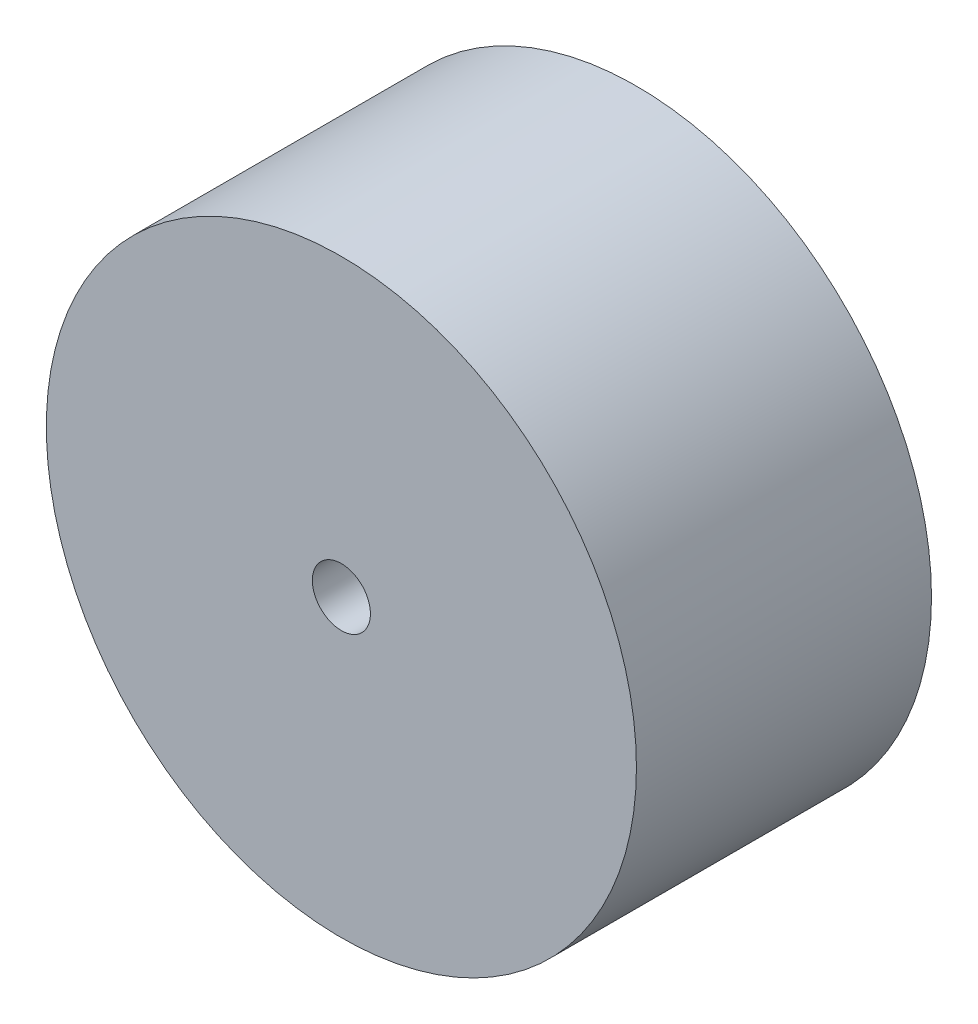
ISO-10303-21;
HEADER;
FILE_DESCRIPTION(('STEP AP214'),'2;1');
FILE_NAME('part.step','',(''),(''),'','','');
FILE_SCHEMA(('AUTOMOTIVE_DESIGN { 1 0 10303 214 1 1 1 1 }'));
ENDSEC;
DATA;
#1=APPLICATION_CONTEXT('core data for automotive mechanical design processes');
#2=APPLICATION_PROTOCOL_DEFINITION('international standard','automotive_design',2000,#1);
#3=PRODUCT_CONTEXT('',#1,'mechanical');
#4=PRODUCT('Part','Part','',(#3));
#5=PRODUCT_RELATED_PRODUCT_CATEGORY('part','',(#4));
#6=PRODUCT_DEFINITION_FORMATION('','',#4);
#7=PRODUCT_DEFINITION_CONTEXT('part definition',#1,'design');
#8=PRODUCT_DEFINITION('design','',#6,#7);
#9=PRODUCT_DEFINITION_SHAPE('','',#8);
#10=(LENGTH_UNIT() NAMED_UNIT(*) SI_UNIT(.MILLI.,.METRE.));
#11=(NAMED_UNIT(*) PLANE_ANGLE_UNIT() SI_UNIT($,.RADIAN.));
#12=(NAMED_UNIT(*) SI_UNIT($,.STERADIAN.) SOLID_ANGLE_UNIT());
#13=UNCERTAINTY_MEASURE_WITH_UNIT(LENGTH_MEASURE(1.E-05),#10,'distance_accuracy_value','');
#14=(GEOMETRIC_REPRESENTATION_CONTEXT(3) GLOBAL_UNCERTAINTY_ASSIGNED_CONTEXT((#13)) GLOBAL_UNIT_ASSIGNED_CONTEXT((#10,
#11,#12)) REPRESENTATION_CONTEXT('',''));
#15=CARTESIAN_POINT('',(0.,0.,0.));
#16=DIRECTION('',(0.,0.,1.));
#17=DIRECTION('',(1.,0.,0.));
#18=AXIS2_PLACEMENT_3D('',#15,#16,#17);
#19=CARTESIAN_POINT('',(0.,0.,25.4));
#20=DIRECTION('',(0.,0.,1.));
#21=DIRECTION('',(1.,0.,0.));
#22=AXIS2_PLACEMENT_3D('',#19,#20,#21);
#23=PLANE('',#22);
#24=CARTESIAN_POINT('',(0.,0.,25.4));
#25=DIRECTION('',(0.,0.,1.));
#26=DIRECTION('',(1.,0.,0.));
#27=AXIS2_PLACEMENT_3D('',#24,#25,#26);
#28=CIRCLE('',#27,25.4);
#29=CARTESIAN_POINT('',(25.4,0.,25.4));
#30=VERTEX_POINT('',#29);
#31=EDGE_CURVE('E10',#30,#30,#28,.T.);
#32=ORIENTED_EDGE('',*,*,#31,.T.);
#33=EDGE_LOOP('',(#32));
#34=FACE_BOUND('',#33,.T.);
#35=CARTESIAN_POINT('',(0.,0.,25.4));
#36=DIRECTION('',(0.,0.,1.));
#37=DIRECTION('',(1.,0.,0.));
#38=AXIS2_PLACEMENT_3D('',#35,#36,#37);
#39=CIRCLE('',#38,2.5);
#40=CARTESIAN_POINT('',(2.5,0.,25.4));
#41=VERTEX_POINT('',#40);
#42=EDGE_CURVE('E42',#41,#41,#39,.T.);
#43=ORIENTED_EDGE('',*,*,#42,.F.);
#44=EDGE_LOOP('',(#43));
#45=FACE_BOUND('',#44,.T.);
#46=ADVANCED_FACE('F31',(#34,#45),#23,.T.);
#47=CARTESIAN_POINT('',(0.,0.,0.));
#48=DIRECTION('',(0.,0.,1.));
#49=DIRECTION('',(1.,0.,0.));
#50=AXIS2_PLACEMENT_3D('',#47,#48,#49);
#51=PLANE('',#50);
#52=CARTESIAN_POINT('',(0.,0.,0.));
#53=DIRECTION('',(0.,0.,1.));
#54=DIRECTION('',(1.,0.,0.));
#55=AXIS2_PLACEMENT_3D('',#52,#53,#54);
#56=CIRCLE('',#55,25.4);
#57=CARTESIAN_POINT('',(25.4,0.,0.));
#58=VERTEX_POINT('',#57);
#59=EDGE_CURVE('E35',#58,#58,#56,.T.);
#60=ORIENTED_EDGE('',*,*,#59,.F.);
#61=EDGE_LOOP('',(#60));
#62=FACE_BOUND('',#61,.T.);
#63=CARTESIAN_POINT('',(0.,0.,0.));
#64=DIRECTION('',(0.,0.,1.));
#65=DIRECTION('',(1.,0.,0.));
#66=AXIS2_PLACEMENT_3D('',#63,#64,#65);
#67=CIRCLE('',#66,2.5);
#68=CARTESIAN_POINT('',(2.5,0.,0.));
#69=VERTEX_POINT('',#68);
#70=EDGE_CURVE('E44',#69,#69,#67,.T.);
#71=ORIENTED_EDGE('',*,*,#70,.T.);
#72=EDGE_LOOP('',(#71));
#73=FACE_BOUND('',#72,.T.);
#74=ADVANCED_FACE('F54',(#62,#73),#51,.F.);
#75=CARTESIAN_POINT('',(0.,0.,25.4));
#76=DIRECTION('',(0.,0.,-1.));
#77=DIRECTION('',(-1.,0.,0.));
#78=AXIS2_PLACEMENT_3D('',#75,#76,#77);
#79=CYLINDRICAL_SURFACE('',#78,25.4);
#80=ORIENTED_EDGE('',*,*,#31,.F.);
#81=EDGE_LOOP('',(#80));
#82=FACE_BOUND('',#81,.T.);
#83=ORIENTED_EDGE('',*,*,#59,.T.);
#84=EDGE_LOOP('',(#83));
#85=FACE_BOUND('',#84,.T.);
#86=ADVANCED_FACE('F33',(#82,#85),#79,.T.);
#87=CARTESIAN_POINT('',(0.,0.,25.4));
#88=DIRECTION('',(0.,0.,-1.));
#89=DIRECTION('',(-1.,0.,0.));
#90=AXIS2_PLACEMENT_3D('',#87,#88,#89);
#91=CYLINDRICAL_SURFACE('',#90,2.5);
#92=ORIENTED_EDGE('',*,*,#42,.T.);
#93=EDGE_LOOP('',(#92));
#94=FACE_BOUND('',#93,.T.);
#95=ORIENTED_EDGE('',*,*,#70,.F.);
#96=EDGE_LOOP('',(#95));
#97=FACE_BOUND('',#96,.T.);
#98=ADVANCED_FACE('F50',(#94,#97),#91,.F.);
#99=CLOSED_SHELL('',(#46,#74,#86,#98));
#100=MANIFOLD_SOLID_BREP('B2',#99);
#101=ADVANCED_BREP_SHAPE_REPRESENTATION('',(#18,#100),#14);
#102=SHAPE_DEFINITION_REPRESENTATION(#9,#101);
ENDSEC;
END-ISO-10303-21;
